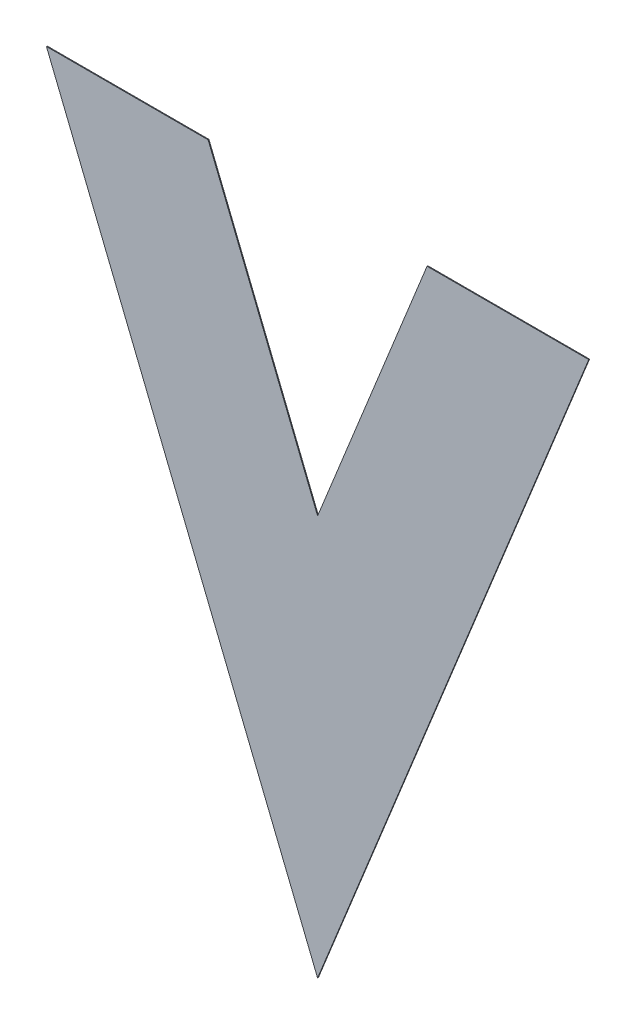
ISO-10303-21;
HEADER;
FILE_DESCRIPTION(('STEP AP214'),'2;1');
FILE_NAME('part.step','',(''),(''),'','','');
FILE_SCHEMA(('AUTOMOTIVE_DESIGN { 1 0 10303 214 1 1 1 1 }'));
ENDSEC;
DATA;
#1=APPLICATION_CONTEXT('core data for automotive mechanical design processes');
#2=APPLICATION_PROTOCOL_DEFINITION('international standard','automotive_design',2000,#1);
#3=PRODUCT_CONTEXT('',#1,'mechanical');
#4=PRODUCT('Part','Part','',(#3));
#5=PRODUCT_RELATED_PRODUCT_CATEGORY('part','',(#4));
#6=PRODUCT_DEFINITION_FORMATION('','',#4);
#7=PRODUCT_DEFINITION_CONTEXT('part definition',#1,'design');
#8=PRODUCT_DEFINITION('design','',#6,#7);
#9=PRODUCT_DEFINITION_SHAPE('','',#8);
#10=(LENGTH_UNIT() NAMED_UNIT(*) SI_UNIT(.MILLI.,.METRE.));
#11=(NAMED_UNIT(*) PLANE_ANGLE_UNIT() SI_UNIT($,.RADIAN.));
#12=(NAMED_UNIT(*) SI_UNIT($,.STERADIAN.) SOLID_ANGLE_UNIT());
#13=UNCERTAINTY_MEASURE_WITH_UNIT(LENGTH_MEASURE(1.E-05),#10,'distance_accuracy_value','');
#14=(GEOMETRIC_REPRESENTATION_CONTEXT(3) GLOBAL_UNCERTAINTY_ASSIGNED_CONTEXT((#13)) GLOBAL_UNIT_ASSIGNED_CONTEXT((#10,
#11,#12)) REPRESENTATION_CONTEXT('',''));
#15=CARTESIAN_POINT('',(0.,0.,0.));
#16=DIRECTION('',(0.,0.,1.));
#17=DIRECTION('',(1.,0.,0.));
#18=AXIS2_PLACEMENT_3D('',#15,#16,#17);
#19=CARTESIAN_POINT('',(0.4894260138488,-0.160259075652,0.0009));
#20=DIRECTION('',(0.,0.,-1.));
#21=DIRECTION('',(-1.,0.,0.));
#22=AXIS2_PLACEMENT_3D('',#19,#20,#21);
#23=PLANE('',#22);
#24=DIRECTION('',(-0.37460659341609,-0.927183854566715,0.));
#25=VECTOR('',#24,1.);
#26=CARTESIAN_POINT('',(0.522329467702,-0.078820169588,0.0009));
#27=LINE('',#26,#25);
#28=CARTESIAN_POINT('',(0.522329467702,-0.078820169588,0.0009));
#29=VERTEX_POINT('',#28);
#30=CARTESIAN_POINT('',(0.4894260138488,-0.160259075652,0.0009));
#31=VERTEX_POINT('',#30);
#32=EDGE_CURVE('E11',#29,#31,#27,.T.);
#33=ORIENTED_EDGE('',*,*,#32,.T.);
#34=DIRECTION('',(-0.37460659341609,0.927183854566715,0.));
#35=VECTOR('',#34,1.);
#36=CARTESIAN_POINT('',(0.4894260138488,-0.160259075652,0.0009));
#37=LINE('',#36,#35);
#38=CARTESIAN_POINT('',(0.4565225599956,-0.078820169588,0.0009));
#39=VERTEX_POINT('',#38);
#40=EDGE_CURVE('E24',#31,#39,#37,.T.);
#41=ORIENTED_EDGE('',*,*,#40,.T.);
#42=DIRECTION('',(1.,0.,0.));
#43=VECTOR('',#42,1.);
#44=CARTESIAN_POINT('',(0.4565225599956,-0.078820169588,0.0009));
#45=LINE('',#44,#43);
#46=CARTESIAN_POINT('',(0.4761425599956,-0.078820169588,0.0009));
#47=VERTEX_POINT('',#46);
#48=EDGE_CURVE('E82',#39,#47,#45,.T.);
#49=ORIENTED_EDGE('',*,*,#48,.T.);
#50=DIRECTION('',(0.374606593416082,-0.927183854566719,0.));
#51=VECTOR('',#50,1.);
#52=CARTESIAN_POINT('',(0.4761425599956,-0.078820169588,0.0009));
#53=LINE('',#52,#51);
#54=CARTESIAN_POINT('',(0.4894260138488,-0.111697871588,0.0009));
#55=VERTEX_POINT('',#54);
#56=EDGE_CURVE('E112',#47,#55,#53,.T.);
#57=ORIENTED_EDGE('',*,*,#56,.T.);
#58=DIRECTION('',(0.374606593415597,0.927183854566915,0.));
#59=VECTOR('',#58,1.);
#60=CARTESIAN_POINT('',(0.4894260138488,-0.111697871588,0.0009));
#61=LINE('',#60,#59);
#62=CARTESIAN_POINT('',(0.50270946770198,-0.078820169588,0.0009));
#63=VERTEX_POINT('',#62);
#64=EDGE_CURVE('E110',#55,#63,#61,.T.);
#65=ORIENTED_EDGE('',*,*,#64,.T.);
#66=DIRECTION('',(1.,0.,0.));
#67=VECTOR('',#66,1.);
#68=CARTESIAN_POINT('',(0.50270946770198,-0.078820169588,0.0009));
#69=LINE('',#68,#67);
#70=EDGE_CURVE('E108',#63,#29,#69,.T.);
#71=ORIENTED_EDGE('',*,*,#70,.T.);
#72=EDGE_LOOP('',(#33,#41,#49,#57,#65,#71));
#73=FACE_BOUND('',#72,.T.);
#74=ADVANCED_FACE('F17',(#73),#23,.T.);
#75=CARTESIAN_POINT('',(0.5058777407754,-0.11953962262,0.0009));
#76=DIRECTION('',(0.927183854566715,-0.37460659341609,0.));
#77=DIRECTION('',(0.,0.,-1.));
#78=AXIS2_PLACEMENT_3D('',#75,#76,#77);
#79=PLANE('',#78);
#80=DIRECTION('',(0.37460659341609,0.927183854566715,0.));
#81=VECTOR('',#80,1.);
#82=CARTESIAN_POINT('',(0.4894260138488,-0.160259075652,0.001));
#83=LINE('',#82,#81);
#84=CARTESIAN_POINT('',(0.4894260138488,-0.160259075652,0.001));
#85=VERTEX_POINT('',#84);
#86=CARTESIAN_POINT('',(0.522329467702,-0.078820169588,0.001));
#87=VERTEX_POINT('',#86);
#88=EDGE_CURVE('E106',#85,#87,#83,.T.);
#89=ORIENTED_EDGE('',*,*,#88,.F.);
#90=DIRECTION('',(0.,0.,-1.));
#91=VECTOR('',#90,1.);
#92=CARTESIAN_POINT('',(0.4894260138488,-0.160259075652,0.001));
#93=LINE('',#92,#91);
#94=EDGE_CURVE('E87',#85,#31,#93,.T.);
#95=ORIENTED_EDGE('',*,*,#94,.T.);
#96=ORIENTED_EDGE('',*,*,#32,.F.);
#97=DIRECTION('',(0.,0.,-1.));
#98=VECTOR('',#97,1.);
#99=CARTESIAN_POINT('',(0.522329467702,-0.078820169588,0.001));
#100=LINE('',#99,#98);
#101=EDGE_CURVE('E102',#87,#29,#100,.T.);
#102=ORIENTED_EDGE('',*,*,#101,.F.);
#103=EDGE_LOOP('',(#89,#95,#96,#102));
#104=FACE_BOUND('',#103,.T.);
#105=ADVANCED_FACE('F115',(#104),#79,.T.);
#106=CARTESIAN_POINT('',(0.51251946770199,-0.078820169588,0.0009));
#107=DIRECTION('',(0.,1.,0.));
#108=DIRECTION('',(0.,0.,1.));
#109=AXIS2_PLACEMENT_3D('',#106,#107,#108);
#110=PLANE('',#109);
#111=DIRECTION('',(-1.,0.,0.));
#112=VECTOR('',#111,1.);
#113=CARTESIAN_POINT('',(0.522329467702,-0.078820169588,0.001));
#114=LINE('',#113,#112);
#115=CARTESIAN_POINT('',(0.50270946770198,-0.078820169588,0.001));
#116=VERTEX_POINT('',#115);
#117=EDGE_CURVE('E100',#87,#116,#114,.T.);
#118=ORIENTED_EDGE('',*,*,#117,.F.);
#119=ORIENTED_EDGE('',*,*,#101,.T.);
#120=ORIENTED_EDGE('',*,*,#70,.F.);
#121=DIRECTION('',(0.,0.,-1.));
#122=VECTOR('',#121,1.);
#123=CARTESIAN_POINT('',(0.50270946770198,-0.078820169588,0.001));
#124=LINE('',#123,#122);
#125=EDGE_CURVE('E97',#116,#63,#124,.T.);
#126=ORIENTED_EDGE('',*,*,#125,.F.);
#127=EDGE_LOOP('',(#118,#119,#120,#126));
#128=FACE_BOUND('',#127,.T.);
#129=ADVANCED_FACE('F122',(#128),#110,.T.);
#130=CARTESIAN_POINT('',(0.49606774077539,-0.095259020588,0.0009));
#131=DIRECTION('',(-0.927183854566915,0.374606593415597,0.));
#132=DIRECTION('',(0.,0.,1.));
#133=AXIS2_PLACEMENT_3D('',#130,#131,#132);
#134=PLANE('',#133);
#135=DIRECTION('',(-0.374606593415597,-0.927183854566915,0.));
#136=VECTOR('',#135,1.);
#137=CARTESIAN_POINT('',(0.50270946770198,-0.078820169588,0.001));
#138=LINE('',#137,#136);
#139=CARTESIAN_POINT('',(0.4894260138488,-0.111697871588,0.001));
#140=VERTEX_POINT('',#139);
#141=EDGE_CURVE('E95',#116,#140,#138,.T.);
#142=ORIENTED_EDGE('',*,*,#141,.F.);
#143=ORIENTED_EDGE('',*,*,#125,.T.);
#144=ORIENTED_EDGE('',*,*,#64,.F.);
#145=DIRECTION('',(0.,0.,-1.));
#146=VECTOR('',#145,1.);
#147=CARTESIAN_POINT('',(0.4894260138488,-0.111697871588,0.001));
#148=LINE('',#147,#146);
#149=EDGE_CURVE('E92',#140,#55,#148,.T.);
#150=ORIENTED_EDGE('',*,*,#149,.F.);
#151=EDGE_LOOP('',(#142,#143,#144,#150));
#152=FACE_BOUND('',#151,.T.);
#153=ADVANCED_FACE('F125',(#152),#134,.T.);
#154=CARTESIAN_POINT('',(0.4827842869222,-0.095259020588,0.0009));
#155=DIRECTION('',(0.927183854566719,0.374606593416082,0.));
#156=DIRECTION('',(0.,0.,-1.));
#157=AXIS2_PLACEMENT_3D('',#154,#155,#156);
#158=PLANE('',#157);
#159=DIRECTION('',(-0.374606593416082,0.927183854566719,0.));
#160=VECTOR('',#159,1.);
#161=CARTESIAN_POINT('',(0.4894260138488,-0.111697871588,0.001));
#162=LINE('',#161,#160);
#163=CARTESIAN_POINT('',(0.4761425599956,-0.078820169588,0.001));
#164=VERTEX_POINT('',#163);
#165=EDGE_CURVE('E72',#140,#164,#162,.T.);
#166=ORIENTED_EDGE('',*,*,#165,.F.);
#167=ORIENTED_EDGE('',*,*,#149,.T.);
#168=ORIENTED_EDGE('',*,*,#56,.F.);
#169=DIRECTION('',(0.,0.,-1.));
#170=VECTOR('',#169,1.);
#171=CARTESIAN_POINT('',(0.4761425599956,-0.078820169588,0.001));
#172=LINE('',#171,#170);
#173=EDGE_CURVE('E76',#164,#47,#172,.T.);
#174=ORIENTED_EDGE('',*,*,#173,.F.);
#175=EDGE_LOOP('',(#166,#167,#168,#174));
#176=FACE_BOUND('',#175,.T.);
#177=ADVANCED_FACE('F127',(#176),#158,.T.);
#178=CARTESIAN_POINT('',(0.4663325599956,-0.078820169588,0.0009));
#179=DIRECTION('',(0.,1.,0.));
#180=DIRECTION('',(0.,0.,1.));
#181=AXIS2_PLACEMENT_3D('',#178,#179,#180);
#182=PLANE('',#181);
#183=DIRECTION('',(-1.,0.,0.));
#184=VECTOR('',#183,1.);
#185=CARTESIAN_POINT('',(0.4761425599956,-0.078820169588,0.001));
#186=LINE('',#185,#184);
#187=CARTESIAN_POINT('',(0.4565225599956,-0.078820169588,0.001));
#188=VERTEX_POINT('',#187);
#189=EDGE_CURVE('E66',#164,#188,#186,.T.);
#190=ORIENTED_EDGE('',*,*,#189,.F.);
#191=ORIENTED_EDGE('',*,*,#173,.T.);
#192=ORIENTED_EDGE('',*,*,#48,.F.);
#193=DIRECTION('',(0.,0.,-1.));
#194=VECTOR('',#193,1.);
#195=CARTESIAN_POINT('',(0.4565225599956,-0.078820169588,0.001));
#196=LINE('',#195,#194);
#197=EDGE_CURVE('E77',#188,#39,#196,.T.);
#198=ORIENTED_EDGE('',*,*,#197,.F.);
#199=EDGE_LOOP('',(#190,#191,#192,#198));
#200=FACE_BOUND('',#199,.T.);
#201=ADVANCED_FACE('F81',(#200),#182,.T.);
#202=CARTESIAN_POINT('',(0.4729742869222,-0.11953962262,0.0009));
#203=DIRECTION('',(-0.927183854566715,-0.37460659341609,0.));
#204=DIRECTION('',(0.,0.,1.));
#205=AXIS2_PLACEMENT_3D('',#202,#203,#204);
#206=PLANE('',#205);
#207=DIRECTION('',(0.37460659341609,-0.927183854566715,0.));
#208=VECTOR('',#207,1.);
#209=CARTESIAN_POINT('',(0.4565225599956,-0.078820169588,0.001));
#210=LINE('',#209,#208);
#211=EDGE_CURVE('E70',#188,#85,#210,.T.);
#212=ORIENTED_EDGE('',*,*,#211,.F.);
#213=ORIENTED_EDGE('',*,*,#197,.T.);
#214=ORIENTED_EDGE('',*,*,#40,.F.);
#215=ORIENTED_EDGE('',*,*,#94,.F.);
#216=EDGE_LOOP('',(#212,#213,#214,#215));
#217=FACE_BOUND('',#216,.T.);
#218=ADVANCED_FACE('F86',(#217),#206,.T.);
#219=CARTESIAN_POINT('',(0.4894260138488,-0.160259075652,0.001));
#220=DIRECTION('',(0.,0.,-1.));
#221=DIRECTION('',(-1.,0.,0.));
#222=AXIS2_PLACEMENT_3D('',#219,#220,#221);
#223=PLANE('',#222);
#224=ORIENTED_EDGE('',*,*,#189,.T.);
#225=ORIENTED_EDGE('',*,*,#211,.T.);
#226=ORIENTED_EDGE('',*,*,#88,.T.);
#227=ORIENTED_EDGE('',*,*,#117,.T.);
#228=ORIENTED_EDGE('',*,*,#141,.T.);
#229=ORIENTED_EDGE('',*,*,#165,.T.);
#230=EDGE_LOOP('',(#224,#225,#226,#227,#228,#229));
#231=FACE_BOUND('',#230,.T.);
#232=ADVANCED_FACE('F68',(#231),#223,.F.);
#233=CLOSED_SHELL('',(#74,#105,#129,#153,#177,#201,#218,#232));
#234=MANIFOLD_SOLID_BREP('B1',#233);
#235=ADVANCED_BREP_SHAPE_REPRESENTATION('',(#18,#234),#14);
#236=SHAPE_DEFINITION_REPRESENTATION(#9,#235);
ENDSEC;
END-ISO-10303-21;
